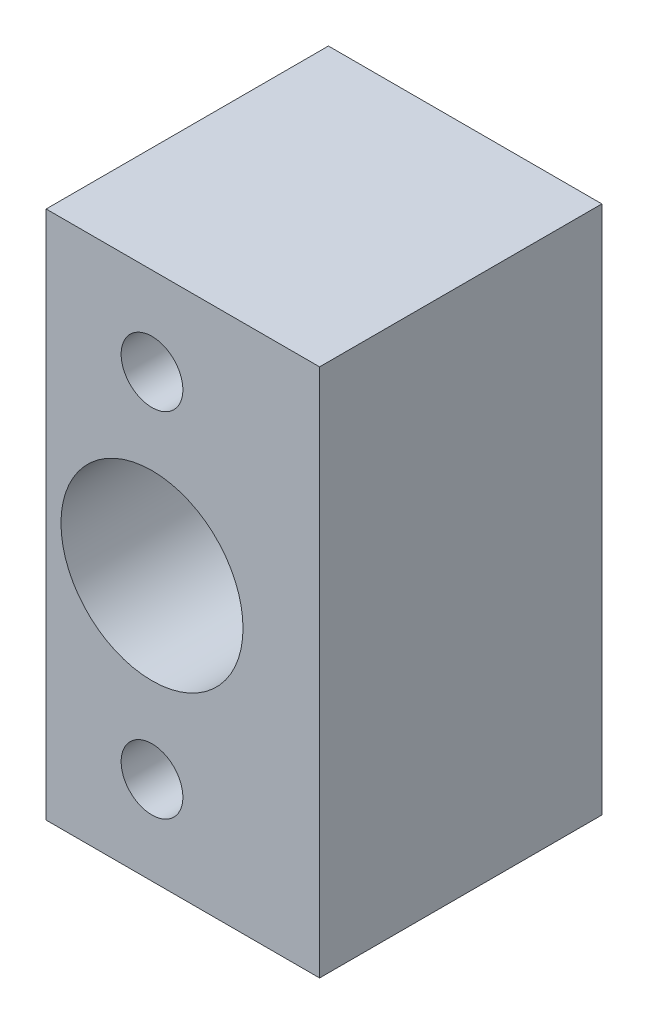
ISO-10303-21;
HEADER;
FILE_DESCRIPTION(('STEP AP214'),'2;1');
FILE_NAME('part.step','',(''),(''),'','','');
FILE_SCHEMA(('AUTOMOTIVE_DESIGN { 1 0 10303 214 1 1 1 1 }'));
ENDSEC;
DATA;
#1=APPLICATION_CONTEXT('core data for automotive mechanical design processes');
#2=APPLICATION_PROTOCOL_DEFINITION('international standard','automotive_design',2000,#1);
#3=PRODUCT_CONTEXT('',#1,'mechanical');
#4=PRODUCT('Part','Part','',(#3));
#5=PRODUCT_RELATED_PRODUCT_CATEGORY('part','',(#4));
#6=PRODUCT_DEFINITION_FORMATION('','',#4);
#7=PRODUCT_DEFINITION_CONTEXT('part definition',#1,'design');
#8=PRODUCT_DEFINITION('design','',#6,#7);
#9=PRODUCT_DEFINITION_SHAPE('','',#8);
#10=(LENGTH_UNIT() NAMED_UNIT(*) SI_UNIT(.MILLI.,.METRE.));
#11=(NAMED_UNIT(*) PLANE_ANGLE_UNIT() SI_UNIT($,.RADIAN.));
#12=(NAMED_UNIT(*) SI_UNIT($,.STERADIAN.) SOLID_ANGLE_UNIT());
#13=UNCERTAINTY_MEASURE_WITH_UNIT(LENGTH_MEASURE(1.E-05),#10,'distance_accuracy_value','');
#14=(GEOMETRIC_REPRESENTATION_CONTEXT(3) GLOBAL_UNCERTAINTY_ASSIGNED_CONTEXT((#13)) GLOBAL_UNIT_ASSIGNED_CONTEXT((#10,
#11,#12)) REPRESENTATION_CONTEXT('',''));
#15=CARTESIAN_POINT('',(0.,0.,0.));
#16=DIRECTION('',(0.,0.,1.));
#17=DIRECTION('',(1.,0.,0.));
#18=AXIS2_PLACEMENT_3D('',#15,#16,#17);
#19=CARTESIAN_POINT('',(0.,9.99999999999999,18.));
#20=DIRECTION('',(0.,0.,-1.));
#21=DIRECTION('',(-1.,0.,0.));
#22=AXIS2_PLACEMENT_3D('',#19,#20,#21);
#23=CYLINDRICAL_SURFACE('',#22,1.75);
#24=CARTESIAN_POINT('',(0.,9.99999999999999,16.));
#25=DIRECTION('',(0.,0.,-1.));
#26=DIRECTION('',(-1.,0.,0.));
#27=AXIS2_PLACEMENT_3D('',#24,#25,#26);
#28=CIRCLE('',#27,1.75);
#29=CARTESIAN_POINT('',(-1.75,9.99999999999999,16.));
#30=VERTEX_POINT('',#29);
#31=EDGE_CURVE('E127',#30,#30,#28,.F.);
#32=ORIENTED_EDGE('',*,*,#31,.T.);
#33=EDGE_LOOP('',(#32));
#34=FACE_BOUND('',#33,.T.);
#35=CARTESIAN_POINT('',(0.,9.99999999999999,4.));
#36=DIRECTION('',(0.,0.,-1.));
#37=DIRECTION('',(-1.,0.,0.));
#38=AXIS2_PLACEMENT_3D('',#35,#36,#37);
#39=CIRCLE('',#38,1.75);
#40=CARTESIAN_POINT('',(-1.75,9.99999999999999,4.));
#41=VERTEX_POINT('',#40);
#42=EDGE_CURVE('E40',#41,#41,#39,.F.);
#43=ORIENTED_EDGE('',*,*,#42,.F.);
#44=EDGE_LOOP('',(#43));
#45=FACE_BOUND('',#44,.T.);
#46=ADVANCED_FACE('F36',(#34,#45),#23,.F.);
#47=CARTESIAN_POINT('',(0.,-10.,18.));
#48=DIRECTION('',(0.,0.,-1.));
#49=DIRECTION('',(-1.,0.,0.));
#50=AXIS2_PLACEMENT_3D('',#47,#48,#49);
#51=CYLINDRICAL_SURFACE('',#50,1.75);
#52=CARTESIAN_POINT('',(0.,-10.,16.));
#53=DIRECTION('',(0.,0.,-1.));
#54=DIRECTION('',(-1.,0.,0.));
#55=AXIS2_PLACEMENT_3D('',#52,#53,#54);
#56=CIRCLE('',#55,1.75);
#57=CARTESIAN_POINT('',(-1.75,-10.,16.));
#58=VERTEX_POINT('',#57);
#59=EDGE_CURVE('E125',#58,#58,#56,.F.);
#60=ORIENTED_EDGE('',*,*,#59,.T.);
#61=EDGE_LOOP('',(#60));
#62=FACE_BOUND('',#61,.T.);
#63=CARTESIAN_POINT('',(0.,-10.,4.));
#64=DIRECTION('',(0.,0.,-1.));
#65=DIRECTION('',(-1.,0.,0.));
#66=AXIS2_PLACEMENT_3D('',#63,#64,#65);
#67=CIRCLE('',#66,1.75);
#68=CARTESIAN_POINT('',(-1.75,-10.,4.));
#69=VERTEX_POINT('',#68);
#70=EDGE_CURVE('E129',#69,#69,#67,.F.);
#71=ORIENTED_EDGE('',*,*,#70,.F.);
#72=EDGE_LOOP('',(#71));
#73=FACE_BOUND('',#72,.T.);
#74=ADVANCED_FACE('F182',(#62,#73),#51,.F.);
#75=CARTESIAN_POINT('',(0.,0.,2.9));
#76=DIRECTION('',(0.,0.,-1.));
#77=DIRECTION('',(-1.,0.,0.));
#78=AXIS2_PLACEMENT_3D('',#75,#76,#77);
#79=CYLINDRICAL_SURFACE('',#78,4.);
#80=CARTESIAN_POINT('',(0.,0.,2.9));
#81=DIRECTION('',(0.,0.,-1.));
#82=DIRECTION('',(-1.,0.,0.));
#83=AXIS2_PLACEMENT_3D('',#80,#81,#82);
#84=CIRCLE('',#83,4.);
#85=CARTESIAN_POINT('',(-4.,0.,2.9));
#86=VERTEX_POINT('',#85);
#87=EDGE_CURVE('E107',#86,#86,#84,.T.);
#88=ORIENTED_EDGE('',*,*,#87,.F.);
#89=EDGE_LOOP('',(#88));
#90=FACE_BOUND('',#89,.T.);
#91=CARTESIAN_POINT('',(0.,0.,0.));
#92=DIRECTION('',(0.,0.,-1.));
#93=DIRECTION('',(-1.,0.,0.));
#94=AXIS2_PLACEMENT_3D('',#91,#92,#93);
#95=CIRCLE('',#94,4.);
#96=CARTESIAN_POINT('',(-4.,0.,0.));
#97=VERTEX_POINT('',#96);
#98=EDGE_CURVE('E157',#97,#97,#95,.F.);
#99=ORIENTED_EDGE('',*,*,#98,.F.);
#100=EDGE_LOOP('',(#99));
#101=FACE_BOUND('',#100,.T.);
#102=ADVANCED_FACE('F178',(#90,#101),#79,.F.);
#103=CARTESIAN_POINT('',(0.,0.,18.));
#104=DIRECTION('',(0.,0.,-1.));
#105=DIRECTION('',(-1.,0.,0.));
#106=AXIS2_PLACEMENT_3D('',#103,#104,#105);
#107=CYLINDRICAL_SURFACE('',#106,2.38125);
#108=CARTESIAN_POINT('',(0.,0.,5.99999999999999));
#109=DIRECTION('',(0.,0.,1.));
#110=DIRECTION('',(1.,0.,0.));
#111=AXIS2_PLACEMENT_3D('',#108,#109,#110);
#112=CIRCLE('',#111,2.38125);
#113=CARTESIAN_POINT('',(2.38125,0.,5.99999999999999));
#114=VERTEX_POINT('',#113);
#115=EDGE_CURVE('E98',#114,#114,#112,.F.);
#116=ORIENTED_EDGE('',*,*,#115,.F.);
#117=EDGE_LOOP('',(#116));
#118=FACE_BOUND('',#117,.T.);
#119=CARTESIAN_POINT('',(0.,0.,2.9));
#120=DIRECTION('',(0.,0.,-1.));
#121=DIRECTION('',(-1.,0.,0.));
#122=AXIS2_PLACEMENT_3D('',#119,#120,#121);
#123=CIRCLE('',#122,2.38125);
#124=CARTESIAN_POINT('',(-2.38125,0.,2.9));
#125=VERTEX_POINT('',#124);
#126=EDGE_CURVE('E104',#125,#125,#123,.T.);
#127=ORIENTED_EDGE('',*,*,#126,.T.);
#128=EDGE_LOOP('',(#127));
#129=FACE_BOUND('',#128,.T.);
#130=ADVANCED_FACE('F181',(#118,#129),#107,.F.);
#131=CARTESIAN_POINT('',(0.,0.,6.5));
#132=DIRECTION('',(0.,0.,1.));
#133=DIRECTION('',(1.,0.,0.));
#134=AXIS2_PLACEMENT_3D('',#131,#132,#133);
#135=CYLINDRICAL_SURFACE('',#134,5.159375);
#136=CARTESIAN_POINT('',(0.,0.,16.));
#137=DIRECTION('',(0.,0.,-1.));
#138=DIRECTION('',(-1.,0.,0.));
#139=AXIS2_PLACEMENT_3D('',#136,#137,#138);
#140=CIRCLE('',#139,5.159375);
#141=CARTESIAN_POINT('',(-5.159375,0.,16.));
#142=VERTEX_POINT('',#141);
#143=EDGE_CURVE('E168',#142,#142,#140,.F.);
#144=ORIENTED_EDGE('',*,*,#143,.T.);
#145=EDGE_LOOP('',(#144));
#146=FACE_BOUND('',#145,.T.);
#147=CARTESIAN_POINT('',(0.,0.,6.5));
#148=DIRECTION('',(0.,0.,1.));
#149=DIRECTION('',(1.,0.,0.));
#150=AXIS2_PLACEMENT_3D('',#147,#148,#149);
#151=CIRCLE('',#150,5.159375);
#152=CARTESIAN_POINT('',(5.159375,0.,6.5));
#153=VERTEX_POINT('',#152);
#154=EDGE_CURVE('E113',#153,#153,#151,.T.);
#155=ORIENTED_EDGE('',*,*,#154,.F.);
#156=EDGE_LOOP('',(#155));
#157=FACE_BOUND('',#156,.T.);
#158=ADVANCED_FACE('F217',(#146,#157),#135,.F.);
#159=CARTESIAN_POINT('',(0.,0.,6.5));
#160=DIRECTION('',(0.,0.,1.));
#161=DIRECTION('',(1.,0.,0.));
#162=AXIS2_PLACEMENT_3D('',#159,#160,#161);
#163=PLANE('',#162);
#164=CARTESIAN_POINT('',(0.,0.,6.5));
#165=DIRECTION('',(0.,0.,1.));
#166=DIRECTION('',(1.,0.,0.));
#167=AXIS2_PLACEMENT_3D('',#164,#165,#166);
#168=CIRCLE('',#167,4.8);
#169=CARTESIAN_POINT('',(4.8,0.,6.5));
#170=VERTEX_POINT('',#169);
#171=EDGE_CURVE('E102',#170,#170,#168,.T.);
#172=ORIENTED_EDGE('',*,*,#171,.F.);
#173=EDGE_LOOP('',(#172));
#174=FACE_BOUND('',#173,.T.);
#175=ORIENTED_EDGE('',*,*,#154,.T.);
#176=EDGE_LOOP('',(#175));
#177=FACE_BOUND('',#176,.T.);
#178=ADVANCED_FACE('F225',(#174,#177),#163,.T.);
#179=CARTESIAN_POINT('',(0.,0.,5.99999999999999));
#180=DIRECTION('',(0.,0.,1.));
#181=DIRECTION('',(1.,0.,0.));
#182=AXIS2_PLACEMENT_3D('',#179,#180,#181);
#183=CYLINDRICAL_SURFACE('',#182,4.8);
#184=CARTESIAN_POINT('',(0.,0.,5.99999999999999));
#185=DIRECTION('',(0.,0.,1.));
#186=DIRECTION('',(1.,0.,0.));
#187=AXIS2_PLACEMENT_3D('',#184,#185,#186);
#188=CIRCLE('',#187,4.8);
#189=CARTESIAN_POINT('',(4.8,0.,5.99999999999999));
#190=VERTEX_POINT('',#189);
#191=EDGE_CURVE('E110',#190,#190,#188,.T.);
#192=ORIENTED_EDGE('',*,*,#191,.F.);
#193=EDGE_LOOP('',(#192));
#194=FACE_BOUND('',#193,.T.);
#195=ORIENTED_EDGE('',*,*,#171,.T.);
#196=EDGE_LOOP('',(#195));
#197=FACE_BOUND('',#196,.T.);
#198=ADVANCED_FACE('F221',(#194,#197),#183,.F.);
#199=CARTESIAN_POINT('',(0.,0.,5.99999999999999));
#200=DIRECTION('',(0.,0.,1.));
#201=DIRECTION('',(1.,0.,0.));
#202=AXIS2_PLACEMENT_3D('',#199,#200,#201);
#203=PLANE('',#202);
#204=ORIENTED_EDGE('',*,*,#115,.T.);
#205=EDGE_LOOP('',(#204));
#206=FACE_BOUND('',#205,.T.);
#207=ORIENTED_EDGE('',*,*,#191,.T.);
#208=EDGE_LOOP('',(#207));
#209=FACE_BOUND('',#208,.T.);
#210=ADVANCED_FACE('F197',(#206,#209),#203,.T.);
#211=CARTESIAN_POINT('',(0.,0.,2.9));
#212=DIRECTION('',(0.,0.,-1.));
#213=DIRECTION('',(-1.,0.,0.));
#214=AXIS2_PLACEMENT_3D('',#211,#212,#213);
#215=PLANE('',#214);
#216=ORIENTED_EDGE('',*,*,#126,.F.);
#217=EDGE_LOOP('',(#216));
#218=FACE_BOUND('',#217,.T.);
#219=ORIENTED_EDGE('',*,*,#87,.T.);
#220=EDGE_LOOP('',(#219));
#221=FACE_BOUND('',#220,.T.);
#222=ADVANCED_FACE('F176',(#218,#221),#215,.T.);
#223=CARTESIAN_POINT('',(-6.00000000000001,26.,0.));
#224=DIRECTION('',(0.,0.,-1.));
#225=DIRECTION('',(-1.,0.,0.));
#226=AXIS2_PLACEMENT_3D('',#223,#224,#225);
#227=PLANE('',#226);
#228=CARTESIAN_POINT('',(0.,9.99999999999999,0.));
#229=DIRECTION('',(0.,0.,-1.));
#230=DIRECTION('',(-1.,0.,0.));
#231=AXIS2_PLACEMENT_3D('',#228,#229,#230);
#232=CIRCLE('',#231,3.81);
#233=CARTESIAN_POINT('',(-3.81,9.99999999999999,0.));
#234=VERTEX_POINT('',#233);
#235=EDGE_CURVE('E136',#234,#234,#232,.T.);
#236=ORIENTED_EDGE('',*,*,#235,.F.);
#237=EDGE_LOOP('',(#236));
#238=FACE_BOUND('',#237,.T.);
#239=CARTESIAN_POINT('',(0.,-10.,0.));
#240=DIRECTION('',(0.,0.,-1.));
#241=DIRECTION('',(-1.,0.,0.));
#242=AXIS2_PLACEMENT_3D('',#239,#240,#241);
#243=CIRCLE('',#242,3.81);
#244=CARTESIAN_POINT('',(-3.81,-10.,0.));
#245=VERTEX_POINT('',#244);
#246=EDGE_CURVE('E146',#245,#245,#243,.T.);
#247=ORIENTED_EDGE('',*,*,#246,.F.);
#248=EDGE_LOOP('',(#247));
#249=FACE_BOUND('',#248,.T.);
#250=DIRECTION('',(0.888425906857429,-0.459020051876338,0.));
#251=VECTOR('',#250,1.);
#252=CARTESIAN_POINT('',(-21.7041356787765,-4.39510131376101,0.));
#253=LINE('',#252,#251);
#254=CARTESIAN_POINT('',(-6.,-12.5089047477955,0.));
#255=VERTEX_POINT('',#254);
#256=CARTESIAN_POINT('',(-1.17852531831396,-15.,0.));
#257=VERTEX_POINT('',#256);
#258=EDGE_CURVE('E53',#255,#257,#253,.T.);
#259=ORIENTED_EDGE('',*,*,#258,.F.);
#260=DIRECTION('',(0.,-1.,0.));
#261=VECTOR('',#260,1.);
#262=CARTESIAN_POINT('',(-6.00000000000001,26.,0.));
#263=LINE('',#262,#261);
#264=CARTESIAN_POINT('',(-6.00000000000001,15.,0.));
#265=VERTEX_POINT('',#264);
#266=EDGE_CURVE('E93',#265,#255,#263,.T.);
#267=ORIENTED_EDGE('',*,*,#266,.F.);
#268=DIRECTION('',(1.,0.,0.));
#269=VECTOR('',#268,1.);
#270=CARTESIAN_POINT('',(9.5,15.,0.));
#271=LINE('',#270,#269);
#272=CARTESIAN_POINT('',(9.5,15.,0.));
#273=VERTEX_POINT('',#272);
#274=EDGE_CURVE('E128',#265,#273,#271,.T.);
#275=ORIENTED_EDGE('',*,*,#274,.T.);
#276=DIRECTION('',(0.,-1.,0.));
#277=VECTOR('',#276,1.);
#278=CARTESIAN_POINT('',(9.49999999999999,26.,0.));
#279=LINE('',#278,#277);
#280=CARTESIAN_POINT('',(9.5,-15.,0.));
#281=VERTEX_POINT('',#280);
#282=EDGE_CURVE('E150',#273,#281,#279,.T.);
#283=ORIENTED_EDGE('',*,*,#282,.T.);
#284=DIRECTION('',(1.,0.,0.));
#285=VECTOR('',#284,1.);
#286=CARTESIAN_POINT('',(-6.,-15.,0.));
#287=LINE('',#286,#285);
#288=EDGE_CURVE('E153',#257,#281,#287,.T.);
#289=ORIENTED_EDGE('',*,*,#288,.F.);
#290=EDGE_LOOP('',(#259,#267,#275,#283,#289));
#291=FACE_BOUND('',#290,.T.);
#292=ORIENTED_EDGE('',*,*,#98,.T.);
#293=EDGE_LOOP('',(#292));
#294=FACE_BOUND('',#293,.T.);
#295=ADVANCED_FACE('F186',(#238,#249,#291,#294),#227,.T.);
#296=CARTESIAN_POINT('',(0.,26.,16.));
#297=DIRECTION('',(0.,0.,-1.));
#298=DIRECTION('',(-1.,0.,0.));
#299=AXIS2_PLACEMENT_3D('',#296,#297,#298);
#300=PLANE('',#299);
#301=ORIENTED_EDGE('',*,*,#31,.F.);
#302=EDGE_LOOP('',(#301));
#303=FACE_BOUND('',#302,.T.);
#304=ORIENTED_EDGE('',*,*,#59,.F.);
#305=EDGE_LOOP('',(#304));
#306=FACE_BOUND('',#305,.T.);
#307=ORIENTED_EDGE('',*,*,#143,.F.);
#308=EDGE_LOOP('',(#307));
#309=FACE_BOUND('',#308,.T.);
#310=DIRECTION('',(0.,-1.,0.));
#311=VECTOR('',#310,1.);
#312=CARTESIAN_POINT('',(-6.00000000000001,26.,16.));
#313=LINE('',#312,#311);
#314=CARTESIAN_POINT('',(-6.00000000000001,15.,16.));
#315=VERTEX_POINT('',#314);
#316=CARTESIAN_POINT('',(-6.,-15.,16.));
#317=VERTEX_POINT('',#316);
#318=EDGE_CURVE('E152',#315,#317,#313,.T.);
#319=ORIENTED_EDGE('',*,*,#318,.T.);
#320=DIRECTION('',(1.,0.,0.));
#321=VECTOR('',#320,1.);
#322=CARTESIAN_POINT('',(0.,-15.,16.));
#323=LINE('',#322,#321);
#324=CARTESIAN_POINT('',(9.5,-15.,16.));
#325=VERTEX_POINT('',#324);
#326=EDGE_CURVE('E97',#317,#325,#323,.T.);
#327=ORIENTED_EDGE('',*,*,#326,.T.);
#328=DIRECTION('',(0.,-1.,0.));
#329=VECTOR('',#328,1.);
#330=CARTESIAN_POINT('',(9.49999999999999,26.,16.));
#331=LINE('',#330,#329);
#332=CARTESIAN_POINT('',(9.5,15.,16.));
#333=VERTEX_POINT('',#332);
#334=EDGE_CURVE('E154',#333,#325,#331,.T.);
#335=ORIENTED_EDGE('',*,*,#334,.F.);
#336=DIRECTION('',(1.,0.,0.));
#337=VECTOR('',#336,1.);
#338=CARTESIAN_POINT('',(9.5,15.,16.));
#339=LINE('',#338,#337);
#340=EDGE_CURVE('E60',#315,#333,#339,.T.);
#341=ORIENTED_EDGE('',*,*,#340,.F.);
#342=EDGE_LOOP('',(#319,#327,#335,#341));
#343=FACE_BOUND('',#342,.T.);
#344=ADVANCED_FACE('F188',(#303,#306,#309,#343),#300,.F.);
#345=CARTESIAN_POINT('',(-6.00000000000001,15.,49.765073093486));
#346=DIRECTION('',(1.,0.,0.));
#347=DIRECTION('',(0.,1.,0.));
#348=AXIS2_PLACEMENT_3D('',#345,#346,#347);
#349=PLANE('',#348);
#350=ORIENTED_EDGE('',*,*,#266,.T.);
#351=DIRECTION('',(0.,-0.470588235294118,0.88235294117647));
#352=VECTOR('',#351,1.);
#353=CARTESIAN_POINT('',(-5.99999999999999,-27.0806655345063,27.3220514750826));
#354=LINE('',#353,#352);
#355=CARTESIAN_POINT('',(-6.,-15.,4.67080359788335));
#356=VERTEX_POINT('',#355);
#357=EDGE_CURVE('E83',#255,#356,#354,.T.);
#358=ORIENTED_EDGE('',*,*,#357,.T.);
#359=DIRECTION('',(0.,0.,-1.));
#360=VECTOR('',#359,1.);
#361=CARTESIAN_POINT('',(-6.,-15.,49.765073093486));
#362=LINE('',#361,#360);
#363=EDGE_CURVE('E91',#317,#356,#362,.T.);
#364=ORIENTED_EDGE('',*,*,#363,.F.);
#365=ORIENTED_EDGE('',*,*,#318,.F.);
#366=DIRECTION('',(0.,0.,-1.));
#367=VECTOR('',#366,1.);
#368=CARTESIAN_POINT('',(-6.00000000000001,15.,49.765073093486));
#369=LINE('',#368,#367);
#370=EDGE_CURVE('E99',#315,#265,#369,.T.);
#371=ORIENTED_EDGE('',*,*,#370,.T.);
#372=EDGE_LOOP('',(#350,#358,#364,#365,#371));
#373=FACE_BOUND('',#372,.T.);
#374=ADVANCED_FACE('F90',(#373),#349,.F.);
#375=CARTESIAN_POINT('',(9.5,15.,18.));
#376=DIRECTION('',(0.,-1.,0.));
#377=DIRECTION('',(1.,0.,0.));
#378=AXIS2_PLACEMENT_3D('',#375,#376,#377);
#379=PLANE('',#378);
#380=ORIENTED_EDGE('',*,*,#370,.F.);
#381=ORIENTED_EDGE('',*,*,#340,.T.);
#382=DIRECTION('',(0.,0.,-1.));
#383=VECTOR('',#382,1.);
#384=CARTESIAN_POINT('',(9.5,15.,18.));
#385=LINE('',#384,#383);
#386=EDGE_CURVE('E118',#333,#273,#385,.T.);
#387=ORIENTED_EDGE('',*,*,#386,.T.);
#388=ORIENTED_EDGE('',*,*,#274,.F.);
#389=EDGE_LOOP('',(#380,#381,#387,#388));
#390=FACE_BOUND('',#389,.T.);
#391=ADVANCED_FACE('F214',(#390),#379,.F.);
#392=CARTESIAN_POINT('',(9.5,15.,18.));
#393=DIRECTION('',(-1.,0.,0.));
#394=DIRECTION('',(0.,-1.,0.));
#395=AXIS2_PLACEMENT_3D('',#392,#393,#394);
#396=PLANE('',#395);
#397=ORIENTED_EDGE('',*,*,#386,.F.);
#398=ORIENTED_EDGE('',*,*,#334,.T.);
#399=DIRECTION('',(0.,0.,-1.));
#400=VECTOR('',#399,1.);
#401=CARTESIAN_POINT('',(9.5,-15.,18.));
#402=LINE('',#401,#400);
#403=EDGE_CURVE('E45',#325,#281,#402,.T.);
#404=ORIENTED_EDGE('',*,*,#403,.T.);
#405=ORIENTED_EDGE('',*,*,#282,.F.);
#406=EDGE_LOOP('',(#397,#398,#404,#405));
#407=FACE_BOUND('',#406,.T.);
#408=ADVANCED_FACE('F234',(#407),#396,.F.);
#409=CARTESIAN_POINT('',(9.5,-15.,18.));
#410=DIRECTION('',(0.,1.,0.));
#411=DIRECTION('',(-1.,0.,0.));
#412=AXIS2_PLACEMENT_3D('',#409,#410,#411);
#413=PLANE('',#412);
#414=ORIENTED_EDGE('',*,*,#363,.T.);
#415=DIRECTION('',(0.718240222789174,0.,-0.695795215827012));
#416=VECTOR('',#415,1.);
#417=CARTESIAN_POINT('',(-4.66527094755653,-15.,3.37778482832874));
#418=LINE('',#417,#416);
#419=EDGE_CURVE('E11',#356,#257,#418,.T.);
#420=ORIENTED_EDGE('',*,*,#419,.T.);
#421=ORIENTED_EDGE('',*,*,#288,.T.);
#422=ORIENTED_EDGE('',*,*,#403,.F.);
#423=ORIENTED_EDGE('',*,*,#326,.F.);
#424=EDGE_LOOP('',(#414,#420,#421,#422,#423));
#425=FACE_BOUND('',#424,.T.);
#426=ADVANCED_FACE('F38',(#425),#413,.F.);
#427=CARTESIAN_POINT('',(-5.17037830454784,-13.3942805894474,0.85638368562803));
#428=DIRECTION('',(0.414810847726077,0.802859705276278,0.428191842814015));
#429=DIRECTION('',(0.,-0.470588235294118,0.882352941176471));
#430=AXIS2_PLACEMENT_3D('',#427,#428,#429);
#431=PLANE('',#430);
#432=ORIENTED_EDGE('',*,*,#258,.T.);
#433=ORIENTED_EDGE('',*,*,#419,.F.);
#434=ORIENTED_EDGE('',*,*,#357,.F.);
#435=EDGE_LOOP('',(#432,#433,#434));
#436=FACE_BOUND('',#435,.T.);
#437=ADVANCED_FACE('F82',(#436),#431,.F.);
#438=CARTESIAN_POINT('',(0.,-10.,4.));
#439=DIRECTION('',(0.,0.,-1.));
#440=DIRECTION('',(-1.,0.,0.));
#441=AXIS2_PLACEMENT_3D('',#438,#439,#440);
#442=PLANE('',#441);
#443=CARTESIAN_POINT('',(0.,-10.,4.));
#444=DIRECTION('',(0.,0.,-1.));
#445=DIRECTION('',(-1.,0.,0.));
#446=AXIS2_PLACEMENT_3D('',#443,#444,#445);
#447=CIRCLE('',#446,3.81);
#448=CARTESIAN_POINT('',(-3.81,-10.,4.));
#449=VERTEX_POINT('',#448);
#450=EDGE_CURVE('E141',#449,#449,#447,.T.);
#451=ORIENTED_EDGE('',*,*,#450,.T.);
#452=EDGE_LOOP('',(#451));
#453=FACE_BOUND('',#452,.T.);
#454=ORIENTED_EDGE('',*,*,#70,.T.);
#455=EDGE_LOOP('',(#454));
#456=FACE_BOUND('',#455,.T.);
#457=ADVANCED_FACE('F246',(#453,#456),#442,.T.);
#458=CARTESIAN_POINT('',(0.,-10.,4.));
#459=DIRECTION('',(0.,0.,-1.));
#460=DIRECTION('',(-1.,0.,0.));
#461=AXIS2_PLACEMENT_3D('',#458,#459,#460);
#462=CYLINDRICAL_SURFACE('',#461,3.81);
#463=ORIENTED_EDGE('',*,*,#450,.F.);
#464=EDGE_LOOP('',(#463));
#465=FACE_BOUND('',#464,.T.);
#466=ORIENTED_EDGE('',*,*,#246,.T.);
#467=EDGE_LOOP('',(#466));
#468=FACE_BOUND('',#467,.T.);
#469=ADVANCED_FACE('F251',(#465,#468),#462,.F.);
#470=CARTESIAN_POINT('',(0.,9.99999999999999,4.));
#471=DIRECTION('',(0.,0.,-1.));
#472=DIRECTION('',(-1.,0.,0.));
#473=AXIS2_PLACEMENT_3D('',#470,#471,#472);
#474=PLANE('',#473);
#475=CARTESIAN_POINT('',(0.,9.99999999999999,4.));
#476=DIRECTION('',(0.,0.,-1.));
#477=DIRECTION('',(-1.,0.,0.));
#478=AXIS2_PLACEMENT_3D('',#475,#476,#477);
#479=CIRCLE('',#478,3.81);
#480=CARTESIAN_POINT('',(-3.81,9.99999999999999,4.));
#481=VERTEX_POINT('',#480);
#482=EDGE_CURVE('E131',#481,#481,#479,.T.);
#483=ORIENTED_EDGE('',*,*,#482,.T.);
#484=EDGE_LOOP('',(#483));
#485=FACE_BOUND('',#484,.T.);
#486=ORIENTED_EDGE('',*,*,#42,.T.);
#487=EDGE_LOOP('',(#486));
#488=FACE_BOUND('',#487,.T.);
#489=ADVANCED_FACE('F256',(#485,#488),#474,.T.);
#490=CARTESIAN_POINT('',(0.,9.99999999999999,4.));
#491=DIRECTION('',(0.,0.,-1.));
#492=DIRECTION('',(-1.,0.,0.));
#493=AXIS2_PLACEMENT_3D('',#490,#491,#492);
#494=CYLINDRICAL_SURFACE('',#493,3.81);
#495=ORIENTED_EDGE('',*,*,#482,.F.);
#496=EDGE_LOOP('',(#495));
#497=FACE_BOUND('',#496,.T.);
#498=ORIENTED_EDGE('',*,*,#235,.T.);
#499=EDGE_LOOP('',(#498));
#500=FACE_BOUND('',#499,.T.);
#501=ADVANCED_FACE('F259',(#497,#500),#494,.F.);
#502=CLOSED_SHELL('',(#46,#74,#102,#130,#158,#178,#198,#210,#222,#295,#344,#374,#391,#408,#426,
#437,#457,#469,#489,#501));
#503=MANIFOLD_SOLID_BREP('B2',#502);
#504=ADVANCED_BREP_SHAPE_REPRESENTATION('',(#18,#503),#14);
#505=SHAPE_DEFINITION_REPRESENTATION(#9,#504);
ENDSEC;
END-ISO-10303-21;
